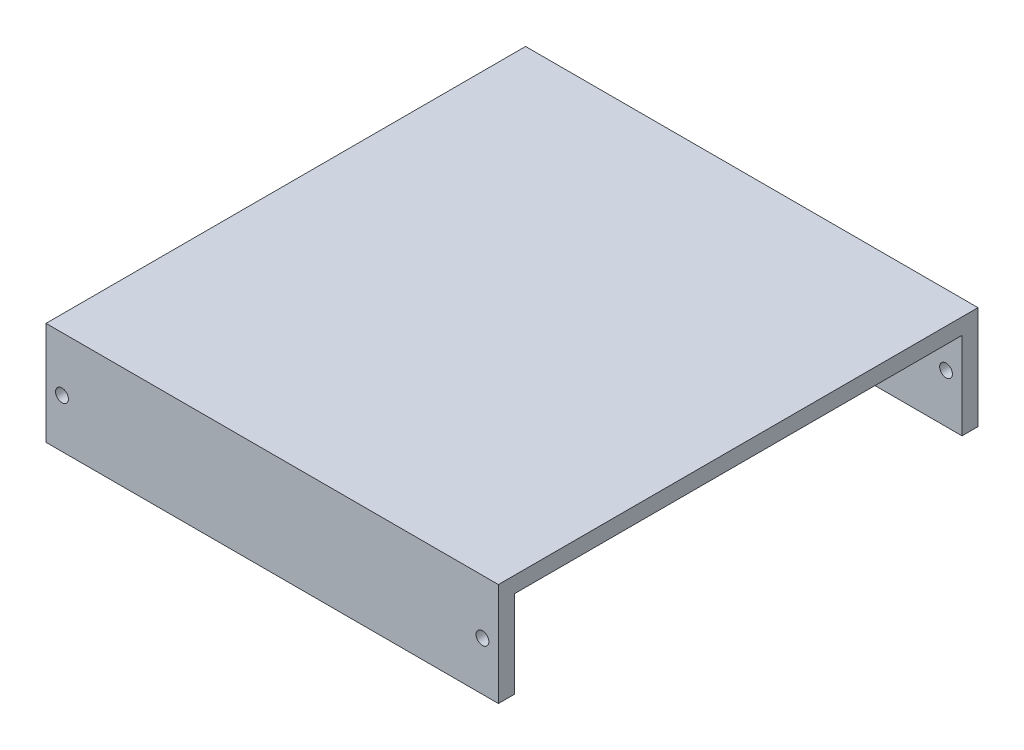
ISO-10303-21;
HEADER;
FILE_DESCRIPTION(('STEP AP214'),'2;1');
FILE_NAME('part.step','',(''),(''),'','','');
FILE_SCHEMA(('AUTOMOTIVE_DESIGN { 1 0 10303 214 1 1 1 1 }'));
ENDSEC;
DATA;
#1=APPLICATION_CONTEXT('core data for automotive mechanical design processes');
#2=APPLICATION_PROTOCOL_DEFINITION('international standard','automotive_design',2000,#1);
#3=PRODUCT_CONTEXT('',#1,'mechanical');
#4=PRODUCT('Part','Part','',(#3));
#5=PRODUCT_RELATED_PRODUCT_CATEGORY('part','',(#4));
#6=PRODUCT_DEFINITION_FORMATION('','',#4);
#7=PRODUCT_DEFINITION_CONTEXT('part definition',#1,'design');
#8=PRODUCT_DEFINITION('design','',#6,#7);
#9=PRODUCT_DEFINITION_SHAPE('','',#8);
#10=(LENGTH_UNIT() NAMED_UNIT(*) SI_UNIT(.MILLI.,.METRE.));
#11=(NAMED_UNIT(*) PLANE_ANGLE_UNIT() SI_UNIT($,.RADIAN.));
#12=(NAMED_UNIT(*) SI_UNIT($,.STERADIAN.) SOLID_ANGLE_UNIT());
#13=UNCERTAINTY_MEASURE_WITH_UNIT(LENGTH_MEASURE(1.E-05),#10,'distance_accuracy_value','');
#14=(GEOMETRIC_REPRESENTATION_CONTEXT(3) GLOBAL_UNCERTAINTY_ASSIGNED_CONTEXT((#13)) GLOBAL_UNIT_ASSIGNED_CONTEXT((#10,
#11,#12)) REPRESENTATION_CONTEXT('',''));
#15=CARTESIAN_POINT('',(0.,0.,0.));
#16=DIRECTION('',(0.,0.,1.));
#17=DIRECTION('',(1.,0.,0.));
#18=AXIS2_PLACEMENT_3D('',#15,#16,#17);
#19=CARTESIAN_POINT('',(222.655000043345,48.,300.));
#20=DIRECTION('',(0.,1.,0.));
#21=DIRECTION('',(-1.,0.,0.));
#22=AXIS2_PLACEMENT_3D('',#19,#20,#21);
#23=PLANE('',#22);
#24=DIRECTION('',(1.,0.,0.));
#25=VECTOR('',#24,1.);
#26=CARTESIAN_POINT('',(222.655000043345,48.,290.));
#27=LINE('',#26,#25);
#28=CARTESIAN_POINT('',(-60.3449999566551,48.,290.));
#29=VERTEX_POINT('',#28);
#30=CARTESIAN_POINT('',(222.655000043345,48.,290.));
#31=VERTEX_POINT('',#30);
#32=EDGE_CURVE('E172',#29,#31,#27,.T.);
#33=ORIENTED_EDGE('',*,*,#32,.F.);
#34=DIRECTION('',(0.,0.,-1.));
#35=VECTOR('',#34,1.);
#36=CARTESIAN_POINT('',(-60.3449999566551,48.,300.));
#37=LINE('',#36,#35);
#38=CARTESIAN_POINT('',(-60.3449999566551,48.,10.));
#39=VERTEX_POINT('',#38);
#40=EDGE_CURVE('E52',#29,#39,#37,.T.);
#41=ORIENTED_EDGE('',*,*,#40,.T.);
#42=DIRECTION('',(-1.,0.,0.));
#43=VECTOR('',#42,1.);
#44=CARTESIAN_POINT('',(212.655000043345,48.,10.));
#45=LINE('',#44,#43);
#46=CARTESIAN_POINT('',(222.655000043345,48.,10.));
#47=VERTEX_POINT('',#46);
#48=EDGE_CURVE('E97',#47,#39,#45,.T.);
#49=ORIENTED_EDGE('',*,*,#48,.F.);
#50=DIRECTION('',(0.,0.,-1.));
#51=VECTOR('',#50,1.);
#52=CARTESIAN_POINT('',(222.655000043345,48.,300.));
#53=LINE('',#52,#51);
#54=EDGE_CURVE('E75',#31,#47,#53,.T.);
#55=ORIENTED_EDGE('',*,*,#54,.F.);
#56=EDGE_LOOP('',(#33,#41,#49,#55));
#57=FACE_BOUND('',#56,.T.);
#58=ADVANCED_FACE('F35',(#57),#23,.F.);
#59=CARTESIAN_POINT('',(0.,0.,10.));
#60=DIRECTION('',(0.,0.,1.));
#61=DIRECTION('',(1.,0.,0.));
#62=AXIS2_PLACEMENT_3D('',#59,#60,#61);
#63=PLANE('',#62);
#64=CARTESIAN_POINT('',(212.655000043345,24.,10.));
#65=DIRECTION('',(0.,0.,1.));
#66=DIRECTION('',(1.,0.,0.));
#67=AXIS2_PLACEMENT_3D('',#64,#65,#66);
#68=CIRCLE('',#67,3.99999999999999);
#69=CARTESIAN_POINT('',(216.655000043345,24.,10.));
#70=VERTEX_POINT('',#69);
#71=EDGE_CURVE('E151',#70,#70,#68,.T.);
#72=ORIENTED_EDGE('',*,*,#71,.F.);
#73=EDGE_LOOP('',(#72));
#74=FACE_BOUND('',#73,.T.);
#75=DIRECTION('',(0.,-1.,0.));
#76=VECTOR('',#75,1.);
#77=CARTESIAN_POINT('',(-60.3449999566551,-6.47,10.));
#78=LINE('',#77,#76);
#79=CARTESIAN_POINT('',(-60.3449999566551,-6.47,10.));
#80=VERTEX_POINT('',#79);
#81=EDGE_CURVE('E92',#39,#80,#78,.T.);
#82=ORIENTED_EDGE('',*,*,#81,.T.);
#83=DIRECTION('',(1.,0.,0.));
#84=VECTOR('',#83,1.);
#85=CARTESIAN_POINT('',(222.655000043345,-6.47,10.));
#86=LINE('',#85,#84);
#87=CARTESIAN_POINT('',(222.655000043345,-6.47,10.));
#88=VERTEX_POINT('',#87);
#89=EDGE_CURVE('E85',#80,#88,#86,.T.);
#90=ORIENTED_EDGE('',*,*,#89,.T.);
#91=DIRECTION('',(0.,1.,0.));
#92=VECTOR('',#91,1.);
#93=CARTESIAN_POINT('',(222.655000043345,-3.53,10.));
#94=LINE('',#93,#92);
#95=EDGE_CURVE('E91',#88,#47,#94,.T.);
#96=ORIENTED_EDGE('',*,*,#95,.T.);
#97=ORIENTED_EDGE('',*,*,#48,.T.);
#98=EDGE_LOOP('',(#82,#90,#96,#97));
#99=FACE_BOUND('',#98,.T.);
#100=CARTESIAN_POINT('',(-50.3449999566551,24.,10.));
#101=DIRECTION('',(0.,0.,1.));
#102=DIRECTION('',(1.,0.,0.));
#103=AXIS2_PLACEMENT_3D('',#100,#101,#102);
#104=CIRCLE('',#103,4.);
#105=CARTESIAN_POINT('',(-46.3449999566551,24.,10.));
#106=VERTEX_POINT('',#105);
#107=EDGE_CURVE('E144',#106,#106,#104,.T.);
#108=ORIENTED_EDGE('',*,*,#107,.F.);
#109=EDGE_LOOP('',(#108));
#110=FACE_BOUND('',#109,.T.);
#111=ADVANCED_FACE('F95',(#74,#99,#110),#63,.T.);
#112=CARTESIAN_POINT('',(0.,0.,0.));
#113=DIRECTION('',(0.,0.,1.));
#114=DIRECTION('',(1.,0.,0.));
#115=AXIS2_PLACEMENT_3D('',#112,#113,#114);
#116=PLANE('',#115);
#117=DIRECTION('',(1.,0.,0.));
#118=VECTOR('',#117,1.);
#119=CARTESIAN_POINT('',(222.655000043345,-6.47,0.));
#120=LINE('',#119,#118);
#121=CARTESIAN_POINT('',(-60.3449999566551,-6.47,0.));
#122=VERTEX_POINT('',#121);
#123=CARTESIAN_POINT('',(222.655000043345,-6.47,0.));
#124=VERTEX_POINT('',#123);
#125=EDGE_CURVE('E135',#122,#124,#120,.T.);
#126=ORIENTED_EDGE('',*,*,#125,.F.);
#127=DIRECTION('',(0.,-1.,0.));
#128=VECTOR('',#127,1.);
#129=CARTESIAN_POINT('',(-60.3449999566551,48.,0.));
#130=LINE('',#129,#128);
#131=CARTESIAN_POINT('',(-60.3449999566551,58.,0.));
#132=VERTEX_POINT('',#131);
#133=EDGE_CURVE('E65',#132,#122,#130,.T.);
#134=ORIENTED_EDGE('',*,*,#133,.F.);
#135=DIRECTION('',(-1.,0.,0.));
#136=VECTOR('',#135,1.);
#137=CARTESIAN_POINT('',(-60.3449999566551,58.,0.));
#138=LINE('',#137,#136);
#139=CARTESIAN_POINT('',(222.655000043345,58.,0.));
#140=VERTEX_POINT('',#139);
#141=EDGE_CURVE('E169',#140,#132,#138,.T.);
#142=ORIENTED_EDGE('',*,*,#141,.F.);
#143=DIRECTION('',(0.,1.,0.));
#144=VECTOR('',#143,1.);
#145=CARTESIAN_POINT('',(222.655000043345,48.,0.));
#146=LINE('',#145,#144);
#147=EDGE_CURVE('E158',#124,#140,#146,.T.);
#148=ORIENTED_EDGE('',*,*,#147,.F.);
#149=EDGE_LOOP('',(#126,#134,#142,#148));
#150=FACE_BOUND('',#149,.T.);
#151=CARTESIAN_POINT('',(212.655000043345,24.,0.));
#152=DIRECTION('',(0.,0.,1.));
#153=DIRECTION('',(1.,0.,0.));
#154=AXIS2_PLACEMENT_3D('',#151,#152,#153);
#155=CIRCLE('',#154,3.99999999999999);
#156=CARTESIAN_POINT('',(216.655000043345,24.,0.));
#157=VERTEX_POINT('',#156);
#158=EDGE_CURVE('E139',#157,#157,#155,.T.);
#159=ORIENTED_EDGE('',*,*,#158,.T.);
#160=EDGE_LOOP('',(#159));
#161=FACE_BOUND('',#160,.T.);
#162=CARTESIAN_POINT('',(-50.3449999566551,24.,0.));
#163=DIRECTION('',(0.,0.,1.));
#164=DIRECTION('',(1.,0.,0.));
#165=AXIS2_PLACEMENT_3D('',#162,#163,#164);
#166=CIRCLE('',#165,4.);
#167=CARTESIAN_POINT('',(-46.3449999566551,24.,0.));
#168=VERTEX_POINT('',#167);
#169=EDGE_CURVE('E142',#168,#168,#166,.T.);
#170=ORIENTED_EDGE('',*,*,#169,.T.);
#171=EDGE_LOOP('',(#170));
#172=FACE_BOUND('',#171,.T.);
#173=ADVANCED_FACE('F120',(#150,#161,#172),#116,.F.);
#174=CARTESIAN_POINT('',(222.655000043345,-6.47,10.));
#175=DIRECTION('',(0.,1.,0.));
#176=DIRECTION('',(0.,0.,1.));
#177=AXIS2_PLACEMENT_3D('',#174,#175,#176);
#178=PLANE('',#177);
#179=ORIENTED_EDGE('',*,*,#125,.T.);
#180=DIRECTION('',(0.,0.,-1.));
#181=VECTOR('',#180,1.);
#182=CARTESIAN_POINT('',(222.655000043345,-6.47,10.));
#183=LINE('',#182,#181);
#184=EDGE_CURVE('E44',#88,#124,#183,.T.);
#185=ORIENTED_EDGE('',*,*,#184,.F.);
#186=ORIENTED_EDGE('',*,*,#89,.F.);
#187=DIRECTION('',(0.,0.,-1.));
#188=VECTOR('',#187,1.);
#189=CARTESIAN_POINT('',(-60.3449999566551,-6.47,10.));
#190=LINE('',#189,#188);
#191=EDGE_CURVE('E11',#80,#122,#190,.T.);
#192=ORIENTED_EDGE('',*,*,#191,.T.);
#193=EDGE_LOOP('',(#179,#185,#186,#192));
#194=FACE_BOUND('',#193,.T.);
#195=ADVANCED_FACE('F37',(#194),#178,.F.);
#196=CARTESIAN_POINT('',(222.655000043345,48.,10.));
#197=DIRECTION('',(-1.,0.,0.));
#198=DIRECTION('',(0.,0.,1.));
#199=AXIS2_PLACEMENT_3D('',#196,#197,#198);
#200=PLANE('',#199);
#201=DIRECTION('',(0.,1.,0.));
#202=VECTOR('',#201,1.);
#203=CARTESIAN_POINT('',(222.655000043345,58.,300.));
#204=LINE('',#203,#202);
#205=CARTESIAN_POINT('',(222.655000043345,-6.47,300.));
#206=VERTEX_POINT('',#205);
#207=CARTESIAN_POINT('',(222.655000043345,58.,300.));
#208=VERTEX_POINT('',#207);
#209=EDGE_CURVE('E171',#206,#208,#204,.T.);
#210=ORIENTED_EDGE('',*,*,#209,.F.);
#211=DIRECTION('',(0.,0.,1.));
#212=VECTOR('',#211,1.);
#213=CARTESIAN_POINT('',(222.655000043345,-6.47,290.));
#214=LINE('',#213,#212);
#215=CARTESIAN_POINT('',(222.655000043345,-6.47,290.));
#216=VERTEX_POINT('',#215);
#217=EDGE_CURVE('E178',#216,#206,#214,.T.);
#218=ORIENTED_EDGE('',*,*,#217,.F.);
#219=DIRECTION('',(0.,1.,0.));
#220=VECTOR('',#219,1.);
#221=CARTESIAN_POINT('',(222.655000043345,-6.47,290.));
#222=LINE('',#221,#220);
#223=EDGE_CURVE('E193',#216,#31,#222,.T.);
#224=ORIENTED_EDGE('',*,*,#223,.T.);
#225=ORIENTED_EDGE('',*,*,#54,.T.);
#226=ORIENTED_EDGE('',*,*,#95,.F.);
#227=ORIENTED_EDGE('',*,*,#184,.T.);
#228=ORIENTED_EDGE('',*,*,#147,.T.);
#229=DIRECTION('',(0.,0.,-1.));
#230=VECTOR('',#229,1.);
#231=CARTESIAN_POINT('',(222.655000043345,58.,300.));
#232=LINE('',#231,#230);
#233=EDGE_CURVE('E148',#208,#140,#232,.T.);
#234=ORIENTED_EDGE('',*,*,#233,.F.);
#235=EDGE_LOOP('',(#210,#218,#224,#225,#226,#227,#228,#234));
#236=FACE_BOUND('',#235,.T.);
#237=ADVANCED_FACE('F105',(#236),#200,.F.);
#238=CARTESIAN_POINT('',(-60.3449999566551,48.,10.));
#239=DIRECTION('',(1.,0.,0.));
#240=DIRECTION('',(0.,0.,-1.));
#241=AXIS2_PLACEMENT_3D('',#238,#239,#240);
#242=PLANE('',#241);
#243=DIRECTION('',(0.,0.,-1.));
#244=VECTOR('',#243,1.);
#245=CARTESIAN_POINT('',(-60.3449999566551,58.,300.));
#246=LINE('',#245,#244);
#247=CARTESIAN_POINT('',(-60.3449999566551,58.,300.));
#248=VERTEX_POINT('',#247);
#249=EDGE_CURVE('E102',#248,#132,#246,.T.);
#250=ORIENTED_EDGE('',*,*,#249,.T.);
#251=ORIENTED_EDGE('',*,*,#133,.T.);
#252=ORIENTED_EDGE('',*,*,#191,.F.);
#253=ORIENTED_EDGE('',*,*,#81,.F.);
#254=ORIENTED_EDGE('',*,*,#40,.F.);
#255=DIRECTION('',(0.,-1.,0.));
#256=VECTOR('',#255,1.);
#257=CARTESIAN_POINT('',(-60.3449999566551,58.,290.));
#258=LINE('',#257,#256);
#259=CARTESIAN_POINT('',(-60.3449999566551,-6.47,290.));
#260=VERTEX_POINT('',#259);
#261=EDGE_CURVE('E199',#29,#260,#258,.T.);
#262=ORIENTED_EDGE('',*,*,#261,.T.);
#263=DIRECTION('',(0.,0.,1.));
#264=VECTOR('',#263,1.);
#265=CARTESIAN_POINT('',(-60.3449999566551,-6.47,290.));
#266=LINE('',#265,#264);
#267=CARTESIAN_POINT('',(-60.3449999566551,-6.47,300.));
#268=VERTEX_POINT('',#267);
#269=EDGE_CURVE('E190',#260,#268,#266,.T.);
#270=ORIENTED_EDGE('',*,*,#269,.T.);
#271=DIRECTION('',(0.,-1.,0.));
#272=VECTOR('',#271,1.);
#273=CARTESIAN_POINT('',(-60.3449999566551,48.,300.));
#274=LINE('',#273,#272);
#275=EDGE_CURVE('E182',#248,#268,#274,.T.);
#276=ORIENTED_EDGE('',*,*,#275,.F.);
#277=EDGE_LOOP('',(#250,#251,#252,#253,#254,#262,#270,#276));
#278=FACE_BOUND('',#277,.T.);
#279=ADVANCED_FACE('F99',(#278),#242,.F.);
#280=CARTESIAN_POINT('',(212.655000043345,24.,10.));
#281=DIRECTION('',(0.,0.,-1.));
#282=DIRECTION('',(-1.,0.,0.));
#283=AXIS2_PLACEMENT_3D('',#280,#281,#282);
#284=CYLINDRICAL_SURFACE('',#283,3.99999999999999);
#285=ORIENTED_EDGE('',*,*,#71,.T.);
#286=EDGE_LOOP('',(#285));
#287=FACE_BOUND('',#286,.T.);
#288=ORIENTED_EDGE('',*,*,#158,.F.);
#289=EDGE_LOOP('',(#288));
#290=FACE_BOUND('',#289,.T.);
#291=ADVANCED_FACE('F104',(#287,#290),#284,.F.);
#292=CARTESIAN_POINT('',(-50.3449999566551,24.,10.));
#293=DIRECTION('',(0.,0.,-1.));
#294=DIRECTION('',(-1.,0.,0.));
#295=AXIS2_PLACEMENT_3D('',#292,#293,#294);
#296=CYLINDRICAL_SURFACE('',#295,4.);
#297=ORIENTED_EDGE('',*,*,#107,.T.);
#298=EDGE_LOOP('',(#297));
#299=FACE_BOUND('',#298,.T.);
#300=ORIENTED_EDGE('',*,*,#169,.F.);
#301=EDGE_LOOP('',(#300));
#302=FACE_BOUND('',#301,.T.);
#303=ADVANCED_FACE('F111',(#299,#302),#296,.F.);
#304=CARTESIAN_POINT('',(-60.3449999566551,58.,300.));
#305=DIRECTION('',(0.,-1.,0.));
#306=DIRECTION('',(0.,0.,-1.));
#307=AXIS2_PLACEMENT_3D('',#304,#305,#306);
#308=PLANE('',#307);
#309=ORIENTED_EDGE('',*,*,#233,.T.);
#310=ORIENTED_EDGE('',*,*,#141,.T.);
#311=ORIENTED_EDGE('',*,*,#249,.F.);
#312=DIRECTION('',(-1.,0.,0.));
#313=VECTOR('',#312,1.);
#314=CARTESIAN_POINT('',(-60.3449999566551,58.,300.));
#315=LINE('',#314,#313);
#316=EDGE_CURVE('E175',#208,#248,#315,.T.);
#317=ORIENTED_EDGE('',*,*,#316,.F.);
#318=EDGE_LOOP('',(#309,#310,#311,#317));
#319=FACE_BOUND('',#318,.T.);
#320=ADVANCED_FACE('F125',(#319),#308,.F.);
#321=CARTESIAN_POINT('',(0.,0.,300.));
#322=DIRECTION('',(0.,0.,-1.));
#323=DIRECTION('',(-1.,0.,0.));
#324=AXIS2_PLACEMENT_3D('',#321,#322,#323);
#325=PLANE('',#324);
#326=ORIENTED_EDGE('',*,*,#275,.T.);
#327=DIRECTION('',(1.,0.,0.));
#328=VECTOR('',#327,1.);
#329=CARTESIAN_POINT('',(-60.3449999566551,-6.47,300.));
#330=LINE('',#329,#328);
#331=EDGE_CURVE('E196',#268,#206,#330,.T.);
#332=ORIENTED_EDGE('',*,*,#331,.T.);
#333=ORIENTED_EDGE('',*,*,#209,.T.);
#334=ORIENTED_EDGE('',*,*,#316,.T.);
#335=EDGE_LOOP('',(#326,#332,#333,#334));
#336=FACE_BOUND('',#335,.T.);
#337=CARTESIAN_POINT('',(-50.3449999566551,24.,300.));
#338=DIRECTION('',(0.,0.,1.));
#339=DIRECTION('',(1.,0.,0.));
#340=AXIS2_PLACEMENT_3D('',#337,#338,#339);
#341=CIRCLE('',#340,3.99999999999999);
#342=CARTESIAN_POINT('',(-46.3449999566551,24.,300.));
#343=VERTEX_POINT('',#342);
#344=EDGE_CURVE('E207',#343,#343,#341,.T.);
#345=ORIENTED_EDGE('',*,*,#344,.F.);
#346=EDGE_LOOP('',(#345));
#347=FACE_BOUND('',#346,.T.);
#348=CARTESIAN_POINT('',(212.655000043345,24.,300.));
#349=DIRECTION('',(0.,0.,1.));
#350=DIRECTION('',(1.,0.,0.));
#351=AXIS2_PLACEMENT_3D('',#348,#349,#350);
#352=CIRCLE('',#351,3.99999999999999);
#353=CARTESIAN_POINT('',(216.655000043345,24.,300.));
#354=VERTEX_POINT('',#353);
#355=EDGE_CURVE('E213',#354,#354,#352,.T.);
#356=ORIENTED_EDGE('',*,*,#355,.F.);
#357=EDGE_LOOP('',(#356));
#358=FACE_BOUND('',#357,.T.);
#359=ADVANCED_FACE('F229',(#336,#347,#358),#325,.F.);
#360=CARTESIAN_POINT('',(0.,0.,290.));
#361=DIRECTION('',(0.,0.,1.));
#362=DIRECTION('',(1.,0.,0.));
#363=AXIS2_PLACEMENT_3D('',#360,#361,#362);
#364=PLANE('',#363);
#365=CARTESIAN_POINT('',(212.655000043345,24.,290.));
#366=DIRECTION('',(0.,0.,1.));
#367=DIRECTION('',(1.,0.,0.));
#368=AXIS2_PLACEMENT_3D('',#365,#366,#367);
#369=CIRCLE('',#368,3.99999999999999);
#370=CARTESIAN_POINT('',(216.655000043345,24.,290.));
#371=VERTEX_POINT('',#370);
#372=EDGE_CURVE('E210',#371,#371,#369,.T.);
#373=ORIENTED_EDGE('',*,*,#372,.T.);
#374=EDGE_LOOP('',(#373));
#375=FACE_BOUND('',#374,.T.);
#376=CARTESIAN_POINT('',(-50.3449999566551,24.,290.));
#377=DIRECTION('',(0.,0.,1.));
#378=DIRECTION('',(1.,0.,0.));
#379=AXIS2_PLACEMENT_3D('',#376,#377,#378);
#380=CIRCLE('',#379,3.99999999999999);
#381=CARTESIAN_POINT('',(-46.3449999566551,24.,290.));
#382=VERTEX_POINT('',#381);
#383=EDGE_CURVE('E200',#382,#382,#380,.T.);
#384=ORIENTED_EDGE('',*,*,#383,.T.);
#385=EDGE_LOOP('',(#384));
#386=FACE_BOUND('',#385,.T.);
#387=ORIENTED_EDGE('',*,*,#261,.F.);
#388=ORIENTED_EDGE('',*,*,#32,.T.);
#389=ORIENTED_EDGE('',*,*,#223,.F.);
#390=DIRECTION('',(1.,0.,0.));
#391=VECTOR('',#390,1.);
#392=CARTESIAN_POINT('',(-60.3449999566551,-6.47,290.));
#393=LINE('',#392,#391);
#394=EDGE_CURVE('E202',#260,#216,#393,.T.);
#395=ORIENTED_EDGE('',*,*,#394,.F.);
#396=EDGE_LOOP('',(#387,#388,#389,#395));
#397=FACE_BOUND('',#396,.T.);
#398=ADVANCED_FACE('F219',(#375,#386,#397),#364,.F.);
#399=CARTESIAN_POINT('',(-60.3449999566551,-6.47,290.));
#400=DIRECTION('',(0.,-1.,0.));
#401=DIRECTION('',(1.,0.,0.));
#402=AXIS2_PLACEMENT_3D('',#399,#400,#401);
#403=PLANE('',#402);
#404=ORIENTED_EDGE('',*,*,#331,.F.);
#405=ORIENTED_EDGE('',*,*,#269,.F.);
#406=ORIENTED_EDGE('',*,*,#394,.T.);
#407=ORIENTED_EDGE('',*,*,#217,.T.);
#408=EDGE_LOOP('',(#404,#405,#406,#407));
#409=FACE_BOUND('',#408,.T.);
#410=ADVANCED_FACE('F235',(#409),#403,.T.);
#411=CARTESIAN_POINT('',(-50.3449999566551,24.,290.));
#412=DIRECTION('',(0.,0.,1.));
#413=DIRECTION('',(1.,0.,0.));
#414=AXIS2_PLACEMENT_3D('',#411,#412,#413);
#415=CYLINDRICAL_SURFACE('',#414,3.99999999999999);
#416=ORIENTED_EDGE('',*,*,#383,.F.);
#417=EDGE_LOOP('',(#416));
#418=FACE_BOUND('',#417,.T.);
#419=ORIENTED_EDGE('',*,*,#344,.T.);
#420=EDGE_LOOP('',(#419));
#421=FACE_BOUND('',#420,.T.);
#422=ADVANCED_FACE('F225',(#418,#421),#415,.F.);
#423=CARTESIAN_POINT('',(212.655000043345,24.,290.));
#424=DIRECTION('',(0.,0.,1.));
#425=DIRECTION('',(1.,0.,0.));
#426=AXIS2_PLACEMENT_3D('',#423,#424,#425);
#427=CYLINDRICAL_SURFACE('',#426,3.99999999999999);
#428=ORIENTED_EDGE('',*,*,#372,.F.);
#429=EDGE_LOOP('',(#428));
#430=FACE_BOUND('',#429,.T.);
#431=ORIENTED_EDGE('',*,*,#355,.T.);
#432=EDGE_LOOP('',(#431));
#433=FACE_BOUND('',#432,.T.);
#434=ADVANCED_FACE('F222',(#430,#433),#427,.F.);
#435=CLOSED_SHELL('',(#58,#111,#173,#195,#237,#279,#291,#303,#320,#359,#398,#410,#422,#434));
#436=MANIFOLD_SOLID_BREP('B2',#435);
#437=ADVANCED_BREP_SHAPE_REPRESENTATION('',(#18,#436),#14);
#438=SHAPE_DEFINITION_REPRESENTATION(#9,#437);
ENDSEC;
END-ISO-10303-21;
